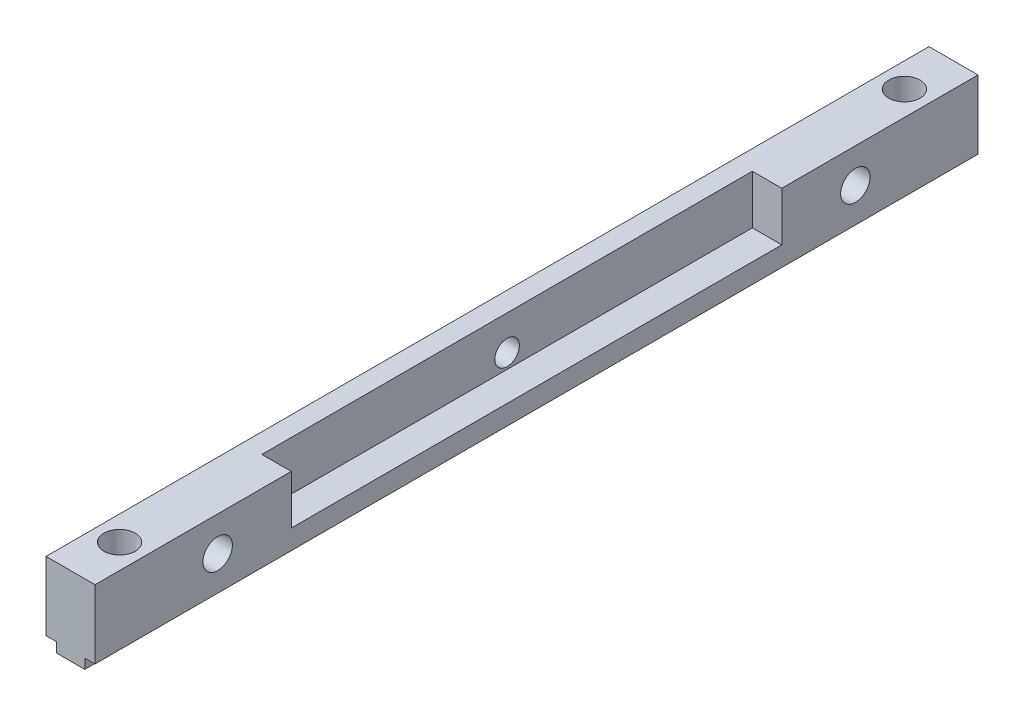
ISO-10303-21;
HEADER;
FILE_DESCRIPTION(('STEP AP214'),'2;1');
FILE_NAME('part.step','',(''),(''),'','','');
FILE_SCHEMA(('AUTOMOTIVE_DESIGN { 1 0 10303 214 1 1 1 1 }'));
ENDSEC;
DATA;
#1=APPLICATION_CONTEXT('core data for automotive mechanical design processes');
#2=APPLICATION_PROTOCOL_DEFINITION('international standard','automotive_design',2000,#1);
#3=PRODUCT_CONTEXT('',#1,'mechanical');
#4=PRODUCT('Part','Part','',(#3));
#5=PRODUCT_RELATED_PRODUCT_CATEGORY('part','',(#4));
#6=PRODUCT_DEFINITION_FORMATION('','',#4);
#7=PRODUCT_DEFINITION_CONTEXT('part definition',#1,'design');
#8=PRODUCT_DEFINITION('design','',#6,#7);
#9=PRODUCT_DEFINITION_SHAPE('','',#8);
#10=(LENGTH_UNIT() NAMED_UNIT(*) SI_UNIT(.MILLI.,.METRE.));
#11=(NAMED_UNIT(*) PLANE_ANGLE_UNIT() SI_UNIT($,.RADIAN.));
#12=(NAMED_UNIT(*) SI_UNIT($,.STERADIAN.) SOLID_ANGLE_UNIT());
#13=UNCERTAINTY_MEASURE_WITH_UNIT(LENGTH_MEASURE(1.E-05),#10,'distance_accuracy_value','');
#14=(GEOMETRIC_REPRESENTATION_CONTEXT(3) GLOBAL_UNCERTAINTY_ASSIGNED_CONTEXT((#13)) GLOBAL_UNIT_ASSIGNED_CONTEXT((#10,
#11,#12)) REPRESENTATION_CONTEXT('',''));
#15=CARTESIAN_POINT('',(0.,0.,0.));
#16=DIRECTION('',(0.,0.,1.));
#17=DIRECTION('',(1.,0.,0.));
#18=AXIS2_PLACEMENT_3D('',#15,#16,#17);
#19=CARTESIAN_POINT('',(3.95,0.,90.));
#20=DIRECTION('',(-1.,0.,0.));
#21=DIRECTION('',(0.,0.,1.));
#22=AXIS2_PLACEMENT_3D('',#19,#20,#21);
#23=PLANE('',#22);
#24=DIRECTION('',(0.,0.,-1.));
#25=VECTOR('',#24,1.);
#26=CARTESIAN_POINT('',(3.95,0.,90.));
#27=LINE('',#26,#25);
#28=CARTESIAN_POINT('',(3.95,0.,4.32361253707657));
#29=VERTEX_POINT('',#28);
#30=CARTESIAN_POINT('',(3.95,0.,0.));
#31=VERTEX_POINT('',#30);
#32=EDGE_CURVE('E304',#29,#31,#27,.T.);
#33=ORIENTED_EDGE('',*,*,#32,.F.);
#34=DIRECTION('',(0.,-1.,0.));
#35=VECTOR('',#34,1.);
#36=CARTESIAN_POINT('',(3.95,7.,4.32361253707657));
#37=LINE('',#36,#35);
#38=CARTESIAN_POINT('',(3.95,-1.,4.32361253707657));
#39=VERTEX_POINT('',#38);
#40=EDGE_CURVE('E57',#29,#39,#37,.T.);
#41=ORIENTED_EDGE('',*,*,#40,.T.);
#42=DIRECTION('',(0.,0.,-1.));
#43=VECTOR('',#42,1.);
#44=CARTESIAN_POINT('',(3.95,-1.,90.));
#45=LINE('',#44,#43);
#46=CARTESIAN_POINT('',(3.95,-1.,0.));
#47=VERTEX_POINT('',#46);
#48=EDGE_CURVE('E308',#39,#47,#45,.T.);
#49=ORIENTED_EDGE('',*,*,#48,.T.);
#50=DIRECTION('',(0.,1.,0.));
#51=VECTOR('',#50,1.);
#52=CARTESIAN_POINT('',(3.95,0.,0.));
#53=LINE('',#52,#51);
#54=EDGE_CURVE('E288',#47,#31,#53,.T.);
#55=ORIENTED_EDGE('',*,*,#54,.T.);
#56=EDGE_LOOP('',(#33,#41,#49,#55));
#57=FACE_BOUND('',#56,.T.);
#58=ADVANCED_FACE('F33',(#57),#23,.F.);
#59=CARTESIAN_POINT('',(1.05,-1.,90.));
#60=DIRECTION('',(1.,0.,0.));
#61=DIRECTION('',(0.,0.,-1.));
#62=AXIS2_PLACEMENT_3D('',#59,#60,#61);
#63=PLANE('',#62);
#64=DIRECTION('',(0.,0.,-1.));
#65=VECTOR('',#64,1.);
#66=CARTESIAN_POINT('',(1.05,0.,90.));
#67=LINE('',#66,#65);
#68=CARTESIAN_POINT('',(1.05,0.,84.3236125370766));
#69=VERTEX_POINT('',#68);
#70=CARTESIAN_POINT('',(1.05,0.,5.67638746292344));
#71=VERTEX_POINT('',#70);
#72=EDGE_CURVE('E321',#69,#71,#67,.T.);
#73=ORIENTED_EDGE('',*,*,#72,.T.);
#74=DIRECTION('',(0.,-1.,0.));
#75=VECTOR('',#74,1.);
#76=CARTESIAN_POINT('',(1.05,7.,5.67638746292344));
#77=LINE('',#76,#75);
#78=CARTESIAN_POINT('',(1.05,-1.,5.67638746292344));
#79=VERTEX_POINT('',#78);
#80=EDGE_CURVE('E218',#71,#79,#77,.T.);
#81=ORIENTED_EDGE('',*,*,#80,.T.);
#82=DIRECTION('',(0.,0.,-1.));
#83=VECTOR('',#82,1.);
#84=CARTESIAN_POINT('',(1.05,-1.,90.));
#85=LINE('',#84,#83);
#86=CARTESIAN_POINT('',(1.05,-1.,84.3236125370766));
#87=VERTEX_POINT('',#86);
#88=EDGE_CURVE('E319',#87,#79,#85,.T.);
#89=ORIENTED_EDGE('',*,*,#88,.F.);
#90=DIRECTION('',(0.,-1.,0.));
#91=VECTOR('',#90,1.);
#92=CARTESIAN_POINT('',(1.05,7.,84.3236125370766));
#93=LINE('',#92,#91);
#94=EDGE_CURVE('E236',#87,#69,#93,.F.);
#95=ORIENTED_EDGE('',*,*,#94,.T.);
#96=EDGE_LOOP('',(#73,#81,#89,#95));
#97=FACE_BOUND('',#96,.T.);
#98=ADVANCED_FACE('F353',(#97),#63,.F.);
#99=CARTESIAN_POINT('',(3.95,-1.,90.));
#100=DIRECTION('',(0.,1.,0.));
#101=DIRECTION('',(-1.,0.,0.));
#102=AXIS2_PLACEMENT_3D('',#99,#100,#101);
#103=PLANE('',#102);
#104=ORIENTED_EDGE('',*,*,#88,.T.);
#105=CARTESIAN_POINT('',(2.5,-1.,5.));
#106=DIRECTION('',(0.,-1.,0.));
#107=DIRECTION('',(0.,0.,-1.));
#108=AXIS2_PLACEMENT_3D('',#105,#106,#107);
#109=CIRCLE('',#108,1.6);
#110=CARTESIAN_POINT('',(3.95,-1.,5.67638746292344));
#111=VERTEX_POINT('',#110);
#112=EDGE_CURVE('E204',#111,#79,#109,.T.);
#113=ORIENTED_EDGE('',*,*,#112,.F.);
#114=CARTESIAN_POINT('',(3.95,-1.,84.3236125370766));
#115=VERTEX_POINT('',#114);
#116=EDGE_CURVE('E314',#115,#111,#45,.T.);
#117=ORIENTED_EDGE('',*,*,#116,.F.);
#118=CARTESIAN_POINT('',(2.5,-1.,85.));
#119=DIRECTION('',(0.,-1.,0.));
#120=DIRECTION('',(0.,0.,-1.));
#121=AXIS2_PLACEMENT_3D('',#118,#119,#120);
#122=CIRCLE('',#121,1.6);
#123=EDGE_CURVE('E221',#87,#115,#122,.T.);
#124=ORIENTED_EDGE('',*,*,#123,.F.);
#125=EDGE_LOOP('',(#104,#113,#117,#124));
#126=FACE_BOUND('',#125,.T.);
#127=ADVANCED_FACE('F349',(#126),#103,.F.);
#128=CARTESIAN_POINT('',(1.05,0.,90.));
#129=VERTEX_POINT('',#128);
#130=CARTESIAN_POINT('',(1.05,0.,85.6763874629234));
#131=VERTEX_POINT('',#130);
#132=EDGE_CURVE('E42',#129,#131,#67,.T.);
#133=ORIENTED_EDGE('',*,*,#132,.T.);
#134=DIRECTION('',(0.,-1.,0.));
#135=VECTOR('',#134,1.);
#136=CARTESIAN_POINT('',(1.05,7.,85.6763874629234));
#137=LINE('',#136,#135);
#138=CARTESIAN_POINT('',(1.05,-1.,85.6763874629234));
#139=VERTEX_POINT('',#138);
#140=EDGE_CURVE('E242',#131,#139,#137,.T.);
#141=ORIENTED_EDGE('',*,*,#140,.T.);
#142=CARTESIAN_POINT('',(1.05,-1.,90.));
#143=VERTEX_POINT('',#142);
#144=EDGE_CURVE('E315',#143,#139,#85,.T.);
#145=ORIENTED_EDGE('',*,*,#144,.F.);
#146=DIRECTION('',(0.,-1.,0.));
#147=VECTOR('',#146,1.);
#148=CARTESIAN_POINT('',(1.05,-1.,90.));
#149=LINE('',#148,#147);
#150=EDGE_CURVE('E264',#129,#143,#149,.T.);
#151=ORIENTED_EDGE('',*,*,#150,.F.);
#152=EDGE_LOOP('',(#133,#141,#145,#151));
#153=FACE_BOUND('',#152,.T.);
#154=ADVANCED_FACE('F360',(#153),#63,.F.);
#155=ORIENTED_EDGE('',*,*,#144,.T.);
#156=CARTESIAN_POINT('',(3.95,-1.,85.6763874629234));
#157=VERTEX_POINT('',#156);
#158=EDGE_CURVE('E226',#157,#139,#122,.T.);
#159=ORIENTED_EDGE('',*,*,#158,.F.);
#160=CARTESIAN_POINT('',(3.95,-1.,90.));
#161=VERTEX_POINT('',#160);
#162=EDGE_CURVE('E310',#161,#157,#45,.T.);
#163=ORIENTED_EDGE('',*,*,#162,.F.);
#164=DIRECTION('',(1.,0.,0.));
#165=VECTOR('',#164,1.);
#166=CARTESIAN_POINT('',(3.95,-1.,90.));
#167=LINE('',#166,#165);
#168=EDGE_CURVE('E266',#143,#161,#167,.T.);
#169=ORIENTED_EDGE('',*,*,#168,.F.);
#170=EDGE_LOOP('',(#155,#159,#163,#169));
#171=FACE_BOUND('',#170,.T.);
#172=ADVANCED_FACE('F363',(#171),#103,.F.);
#173=ORIENTED_EDGE('',*,*,#116,.T.);
#174=DIRECTION('',(0.,-1.,0.));
#175=VECTOR('',#174,1.);
#176=CARTESIAN_POINT('',(3.95,7.,5.67638746292343));
#177=LINE('',#176,#175);
#178=CARTESIAN_POINT('',(3.95,0.,5.67638746292344));
#179=VERTEX_POINT('',#178);
#180=EDGE_CURVE('E208',#111,#179,#177,.F.);
#181=ORIENTED_EDGE('',*,*,#180,.T.);
#182=CARTESIAN_POINT('',(3.95,0.,84.3236125370766));
#183=VERTEX_POINT('',#182);
#184=EDGE_CURVE('E309',#183,#179,#27,.T.);
#185=ORIENTED_EDGE('',*,*,#184,.F.);
#186=DIRECTION('',(0.,-1.,0.));
#187=VECTOR('',#186,1.);
#188=CARTESIAN_POINT('',(3.95,7.,84.3236125370766));
#189=LINE('',#188,#187);
#190=EDGE_CURVE('E233',#183,#115,#189,.T.);
#191=ORIENTED_EDGE('',*,*,#190,.T.);
#192=EDGE_LOOP('',(#173,#181,#185,#191));
#193=FACE_BOUND('',#192,.T.);
#194=ADVANCED_FACE('F387',(#193),#23,.F.);
#195=CARTESIAN_POINT('',(0.,0.,90.));
#196=DIRECTION('',(1.,0.,0.));
#197=DIRECTION('',(0.,0.,-1.));
#198=AXIS2_PLACEMENT_3D('',#195,#196,#197);
#199=PLANE('',#198);
#200=CARTESIAN_POINT('',(0.,3.49999999999999,45.));
#201=DIRECTION('',(-1.,0.,0.));
#202=DIRECTION('',(0.,0.,1.));
#203=AXIS2_PLACEMENT_3D('',#200,#201,#202);
#204=CIRCLE('',#203,1.25);
#205=CARTESIAN_POINT('',(0.,3.49999999999999,46.25));
#206=VERTEX_POINT('',#205);
#207=EDGE_CURVE('E619',#206,#206,#204,.T.);
#208=ORIENTED_EDGE('',*,*,#207,.F.);
#209=EDGE_LOOP('',(#208));
#210=FACE_BOUND('',#209,.T.);
#211=CARTESIAN_POINT('',(0.,3.5,77.5));
#212=DIRECTION('',(1.,0.,0.));
#213=DIRECTION('',(0.,0.,-1.));
#214=AXIS2_PLACEMENT_3D('',#211,#212,#213);
#215=CIRCLE('',#214,1.5);
#216=CARTESIAN_POINT('',(0.,3.5,76.));
#217=VERTEX_POINT('',#216);
#218=EDGE_CURVE('E246',#217,#217,#215,.T.);
#219=ORIENTED_EDGE('',*,*,#218,.T.);
#220=EDGE_LOOP('',(#219));
#221=FACE_BOUND('',#220,.T.);
#222=CARTESIAN_POINT('',(0.,3.5,12.5));
#223=DIRECTION('',(1.,0.,0.));
#224=DIRECTION('',(0.,0.,-1.));
#225=AXIS2_PLACEMENT_3D('',#222,#223,#224);
#226=CIRCLE('',#225,1.5);
#227=CARTESIAN_POINT('',(0.,3.5,11.));
#228=VERTEX_POINT('',#227);
#229=EDGE_CURVE('E252',#228,#228,#226,.T.);
#230=ORIENTED_EDGE('',*,*,#229,.T.);
#231=EDGE_LOOP('',(#230));
#232=FACE_BOUND('',#231,.T.);
#233=DIRECTION('',(0.,-1.,0.));
#234=VECTOR('',#233,1.);
#235=CARTESIAN_POINT('',(0.,0.,0.));
#236=LINE('',#235,#234);
#237=CARTESIAN_POINT('',(0.,7.,0.));
#238=VERTEX_POINT('',#237);
#239=CARTESIAN_POINT('',(0.,0.,0.));
#240=VERTEX_POINT('',#239);
#241=EDGE_CURVE('E255',#238,#240,#236,.T.);
#242=ORIENTED_EDGE('',*,*,#241,.T.);
#243=DIRECTION('',(0.,0.,-1.));
#244=VECTOR('',#243,1.);
#245=CARTESIAN_POINT('',(0.,0.,90.));
#246=LINE('',#245,#244);
#247=CARTESIAN_POINT('',(0.,0.,90.));
#248=VERTEX_POINT('',#247);
#249=EDGE_CURVE('E11',#248,#240,#246,.T.);
#250=ORIENTED_EDGE('',*,*,#249,.F.);
#251=DIRECTION('',(0.,-1.,0.));
#252=VECTOR('',#251,1.);
#253=CARTESIAN_POINT('',(0.,0.,90.));
#254=LINE('',#253,#252);
#255=CARTESIAN_POINT('',(0.,7.,90.));
#256=VERTEX_POINT('',#255);
#257=EDGE_CURVE('E258',#256,#248,#254,.T.);
#258=ORIENTED_EDGE('',*,*,#257,.F.);
#259=DIRECTION('',(0.,0.,-1.));
#260=VECTOR('',#259,1.);
#261=CARTESIAN_POINT('',(0.,7.,90.));
#262=LINE('',#261,#260);
#263=EDGE_CURVE('E276',#256,#238,#262,.T.);
#264=ORIENTED_EDGE('',*,*,#263,.T.);
#265=EDGE_LOOP('',(#242,#250,#258,#264));
#266=FACE_BOUND('',#265,.T.);
#267=ADVANCED_FACE('F35',(#210,#221,#232,#266),#199,.F.);
#268=CARTESIAN_POINT('',(1.05,0.,90.));
#269=DIRECTION('',(0.,1.,0.));
#270=DIRECTION('',(-1.,0.,0.));
#271=AXIS2_PLACEMENT_3D('',#268,#269,#270);
#272=PLANE('',#271);
#273=CARTESIAN_POINT('',(1.05,0.,4.32361253707656));
#274=VERTEX_POINT('',#273);
#275=CARTESIAN_POINT('',(1.05,0.,0.));
#276=VERTEX_POINT('',#275);
#277=EDGE_CURVE('E318',#274,#276,#67,.T.);
#278=ORIENTED_EDGE('',*,*,#277,.F.);
#279=CARTESIAN_POINT('',(2.5,0.,5.));
#280=DIRECTION('',(0.,1.,0.));
#281=DIRECTION('',(-1.,0.,0.));
#282=AXIS2_PLACEMENT_3D('',#279,#280,#281);
#283=CIRCLE('',#282,1.6);
#284=EDGE_CURVE('E215',#274,#71,#283,.T.);
#285=ORIENTED_EDGE('',*,*,#284,.T.);
#286=ORIENTED_EDGE('',*,*,#72,.F.);
#287=CARTESIAN_POINT('',(2.5,0.,85.));
#288=DIRECTION('',(0.,1.,0.));
#289=DIRECTION('',(-1.,0.,0.));
#290=AXIS2_PLACEMENT_3D('',#287,#288,#289);
#291=CIRCLE('',#290,1.6);
#292=EDGE_CURVE('E239',#69,#131,#291,.T.);
#293=ORIENTED_EDGE('',*,*,#292,.T.);
#294=ORIENTED_EDGE('',*,*,#132,.F.);
#295=DIRECTION('',(1.,0.,0.));
#296=VECTOR('',#295,1.);
#297=CARTESIAN_POINT('',(1.05,0.,90.));
#298=LINE('',#297,#296);
#299=EDGE_CURVE('E261',#248,#129,#298,.T.);
#300=ORIENTED_EDGE('',*,*,#299,.F.);
#301=ORIENTED_EDGE('',*,*,#249,.T.);
#302=DIRECTION('',(1.,0.,0.));
#303=VECTOR('',#302,1.);
#304=CARTESIAN_POINT('',(1.05,0.,0.));
#305=LINE('',#304,#303);
#306=EDGE_CURVE('E279',#240,#276,#305,.T.);
#307=ORIENTED_EDGE('',*,*,#306,.T.);
#308=EDGE_LOOP('',(#278,#285,#286,#293,#294,#300,#301,#307));
#309=FACE_BOUND('',#308,.T.);
#310=ADVANCED_FACE('F333',(#309),#272,.F.);
#311=CARTESIAN_POINT('',(1.05,-1.,4.32361253707657));
#312=VERTEX_POINT('',#311);
#313=CARTESIAN_POINT('',(1.05,-1.,0.));
#314=VERTEX_POINT('',#313);
#315=EDGE_CURVE('E313',#312,#314,#85,.T.);
#316=ORIENTED_EDGE('',*,*,#315,.F.);
#317=DIRECTION('',(0.,-1.,0.));
#318=VECTOR('',#317,1.);
#319=CARTESIAN_POINT('',(1.05,7.,4.32361253707656));
#320=LINE('',#319,#318);
#321=EDGE_CURVE('E212',#312,#274,#320,.F.);
#322=ORIENTED_EDGE('',*,*,#321,.T.);
#323=ORIENTED_EDGE('',*,*,#277,.T.);
#324=DIRECTION('',(0.,-1.,0.));
#325=VECTOR('',#324,1.);
#326=CARTESIAN_POINT('',(1.05,-1.,0.));
#327=LINE('',#326,#325);
#328=EDGE_CURVE('E282',#276,#314,#327,.T.);
#329=ORIENTED_EDGE('',*,*,#328,.T.);
#330=EDGE_LOOP('',(#316,#322,#323,#329));
#331=FACE_BOUND('',#330,.T.);
#332=ADVANCED_FACE('F329',(#331),#63,.F.);
#333=ORIENTED_EDGE('',*,*,#48,.F.);
#334=EDGE_CURVE('E205',#312,#39,#109,.T.);
#335=ORIENTED_EDGE('',*,*,#334,.F.);
#336=ORIENTED_EDGE('',*,*,#315,.T.);
#337=DIRECTION('',(1.,0.,0.));
#338=VECTOR('',#337,1.);
#339=CARTESIAN_POINT('',(3.95,-1.,0.));
#340=LINE('',#339,#338);
#341=EDGE_CURVE('E285',#314,#47,#340,.T.);
#342=ORIENTED_EDGE('',*,*,#341,.T.);
#343=EDGE_LOOP('',(#333,#335,#336,#342));
#344=FACE_BOUND('',#343,.T.);
#345=ADVANCED_FACE('F342',(#344),#103,.F.);
#346=ORIENTED_EDGE('',*,*,#162,.T.);
#347=DIRECTION('',(0.,-1.,0.));
#348=VECTOR('',#347,1.);
#349=CARTESIAN_POINT('',(3.95,7.,85.6763874629234));
#350=LINE('',#349,#348);
#351=CARTESIAN_POINT('',(3.95,0.,85.6763874629234));
#352=VERTEX_POINT('',#351);
#353=EDGE_CURVE('E230',#157,#352,#350,.F.);
#354=ORIENTED_EDGE('',*,*,#353,.T.);
#355=CARTESIAN_POINT('',(3.95,0.,90.));
#356=VERTEX_POINT('',#355);
#357=EDGE_CURVE('E305',#356,#352,#27,.T.);
#358=ORIENTED_EDGE('',*,*,#357,.F.);
#359=DIRECTION('',(0.,1.,0.));
#360=VECTOR('',#359,1.);
#361=CARTESIAN_POINT('',(3.95,0.,90.));
#362=LINE('',#361,#360);
#363=EDGE_CURVE('E268',#161,#356,#362,.T.);
#364=ORIENTED_EDGE('',*,*,#363,.F.);
#365=EDGE_LOOP('',(#346,#354,#358,#364));
#366=FACE_BOUND('',#365,.T.);
#367=ADVANCED_FACE('F390',(#366),#23,.F.);
#368=CARTESIAN_POINT('',(4.99999999999999,0.,90.));
#369=DIRECTION('',(0.,1.,0.));
#370=DIRECTION('',(-1.,0.,0.));
#371=AXIS2_PLACEMENT_3D('',#368,#369,#370);
#372=PLANE('',#371);
#373=ORIENTED_EDGE('',*,*,#184,.T.);
#374=CARTESIAN_POINT('',(2.5,0.,5.));
#375=DIRECTION('',(0.,1.,0.));
#376=DIRECTION('',(-1.,0.,0.));
#377=AXIS2_PLACEMENT_3D('',#374,#375,#376);
#378=CIRCLE('',#377,1.6);
#379=EDGE_CURVE('E203',#179,#29,#378,.T.);
#380=ORIENTED_EDGE('',*,*,#379,.T.);
#381=ORIENTED_EDGE('',*,*,#32,.T.);
#382=DIRECTION('',(1.,0.,0.));
#383=VECTOR('',#382,1.);
#384=CARTESIAN_POINT('',(4.99999999999999,0.,0.));
#385=LINE('',#384,#383);
#386=CARTESIAN_POINT('',(4.99999999999999,0.,0.));
#387=VERTEX_POINT('',#386);
#388=EDGE_CURVE('E291',#31,#387,#385,.T.);
#389=ORIENTED_EDGE('',*,*,#388,.T.);
#390=DIRECTION('',(0.,0.,-1.));
#391=VECTOR('',#390,1.);
#392=CARTESIAN_POINT('',(4.99999999999999,0.,90.));
#393=LINE('',#392,#391);
#394=CARTESIAN_POINT('',(4.99999999999999,0.,90.));
#395=VERTEX_POINT('',#394);
#396=EDGE_CURVE('E301',#395,#387,#393,.T.);
#397=ORIENTED_EDGE('',*,*,#396,.F.);
#398=DIRECTION('',(1.,0.,0.));
#399=VECTOR('',#398,1.);
#400=CARTESIAN_POINT('',(4.99999999999999,0.,90.));
#401=LINE('',#400,#399);
#402=EDGE_CURVE('E270',#356,#395,#401,.T.);
#403=ORIENTED_EDGE('',*,*,#402,.F.);
#404=ORIENTED_EDGE('',*,*,#357,.T.);
#405=CARTESIAN_POINT('',(2.5,0.,85.));
#406=DIRECTION('',(0.,1.,0.));
#407=DIRECTION('',(-1.,0.,0.));
#408=AXIS2_PLACEMENT_3D('',#405,#406,#407);
#409=CIRCLE('',#408,1.6);
#410=EDGE_CURVE('E225',#352,#183,#409,.T.);
#411=ORIENTED_EDGE('',*,*,#410,.T.);
#412=EDGE_LOOP('',(#373,#380,#381,#389,#397,#403,#404,#411));
#413=FACE_BOUND('',#412,.T.);
#414=ADVANCED_FACE('F383',(#413),#372,.F.);
#415=CARTESIAN_POINT('',(4.99999999999999,7.,90.));
#416=DIRECTION('',(-1.,0.,0.));
#417=DIRECTION('',(0.,-1.,0.));
#418=AXIS2_PLACEMENT_3D('',#415,#416,#417);
#419=PLANE('',#418);
#420=CARTESIAN_POINT('',(4.99999999999999,3.5,77.5));
#421=DIRECTION('',(1.,0.,0.));
#422=DIRECTION('',(0.,0.,-1.));
#423=AXIS2_PLACEMENT_3D('',#420,#421,#422);
#424=CIRCLE('',#423,1.5);
#425=CARTESIAN_POINT('',(4.99999999999999,3.5,76.));
#426=VERTEX_POINT('',#425);
#427=EDGE_CURVE('E245',#426,#426,#424,.T.);
#428=ORIENTED_EDGE('',*,*,#427,.F.);
#429=EDGE_LOOP('',(#428));
#430=FACE_BOUND('',#429,.T.);
#431=CARTESIAN_POINT('',(4.99999999999999,3.5,12.5));
#432=DIRECTION('',(1.,0.,0.));
#433=DIRECTION('',(0.,0.,-1.));
#434=AXIS2_PLACEMENT_3D('',#431,#432,#433);
#435=CIRCLE('',#434,1.5);
#436=CARTESIAN_POINT('',(4.99999999999999,3.5,11.));
#437=VERTEX_POINT('',#436);
#438=EDGE_CURVE('E249',#437,#437,#435,.T.);
#439=ORIENTED_EDGE('',*,*,#438,.F.);
#440=EDGE_LOOP('',(#439));
#441=FACE_BOUND('',#440,.T.);
#442=DIRECTION('',(0.,0.,-1.));
#443=VECTOR('',#442,1.);
#444=CARTESIAN_POINT('',(4.99999999999999,7.,90.));
#445=LINE('',#444,#443);
#446=CARTESIAN_POINT('',(4.99999999999999,7.,20.));
#447=VERTEX_POINT('',#446);
#448=CARTESIAN_POINT('',(4.99999999999999,7.,0.));
#449=VERTEX_POINT('',#448);
#450=EDGE_CURVE('E299',#447,#449,#445,.T.);
#451=ORIENTED_EDGE('',*,*,#450,.F.);
#452=DIRECTION('',(0.,1.,0.));
#453=VECTOR('',#452,1.);
#454=CARTESIAN_POINT('',(4.99999999999999,2.,20.));
#455=LINE('',#454,#453);
#456=CARTESIAN_POINT('',(4.99999999999999,2.,20.));
#457=VERTEX_POINT('',#456);
#458=EDGE_CURVE('E611',#457,#447,#455,.T.);
#459=ORIENTED_EDGE('',*,*,#458,.F.);
#460=DIRECTION('',(0.,0.,-1.));
#461=VECTOR('',#460,1.);
#462=CARTESIAN_POINT('',(4.99999999999999,2.,20.));
#463=LINE('',#462,#461);
#464=CARTESIAN_POINT('',(4.99999999999999,1.99999999999999,70.));
#465=VERTEX_POINT('',#464);
#466=EDGE_CURVE('E616',#465,#457,#463,.T.);
#467=ORIENTED_EDGE('',*,*,#466,.F.);
#468=DIRECTION('',(0.,-1.,0.));
#469=VECTOR('',#468,1.);
#470=CARTESIAN_POINT('',(4.99999999999999,1.99999999999999,70.));
#471=LINE('',#470,#469);
#472=CARTESIAN_POINT('',(4.99999999999999,7.,70.));
#473=VERTEX_POINT('',#472);
#474=EDGE_CURVE('E614',#473,#465,#471,.T.);
#475=ORIENTED_EDGE('',*,*,#474,.F.);
#476=CARTESIAN_POINT('',(4.99999999999999,7.,90.));
#477=VERTEX_POINT('',#476);
#478=EDGE_CURVE('E192',#477,#473,#445,.T.);
#479=ORIENTED_EDGE('',*,*,#478,.F.);
#480=DIRECTION('',(0.,1.,0.));
#481=VECTOR('',#480,1.);
#482=CARTESIAN_POINT('',(4.99999999999999,7.,90.));
#483=LINE('',#482,#481);
#484=EDGE_CURVE('E272',#395,#477,#483,.T.);
#485=ORIENTED_EDGE('',*,*,#484,.F.);
#486=ORIENTED_EDGE('',*,*,#396,.T.);
#487=DIRECTION('',(0.,1.,0.));
#488=VECTOR('',#487,1.);
#489=CARTESIAN_POINT('',(4.99999999999999,7.,0.));
#490=LINE('',#489,#488);
#491=EDGE_CURVE('E293',#387,#449,#490,.T.);
#492=ORIENTED_EDGE('',*,*,#491,.T.);
#493=EDGE_LOOP('',(#451,#459,#467,#475,#479,#485,#486,#492));
#494=FACE_BOUND('',#493,.T.);
#495=ADVANCED_FACE('F377',(#430,#441,#494),#419,.F.);
#496=CARTESIAN_POINT('',(0.,7.,90.));
#497=DIRECTION('',(0.,-1.,0.));
#498=DIRECTION('',(0.,0.,-1.));
#499=AXIS2_PLACEMENT_3D('',#496,#497,#498);
#500=PLANE('',#499);
#501=CARTESIAN_POINT('',(2.5,7.,5.));
#502=DIRECTION('',(0.,-1.,0.));
#503=DIRECTION('',(0.,0.,-1.));
#504=AXIS2_PLACEMENT_3D('',#501,#502,#503);
#505=CIRCLE('',#504,1.6);
#506=CARTESIAN_POINT('',(2.5,7.,3.4));
#507=VERTEX_POINT('',#506);
#508=EDGE_CURVE('E200',#507,#507,#505,.T.);
#509=ORIENTED_EDGE('',*,*,#508,.T.);
#510=EDGE_LOOP('',(#509));
#511=FACE_BOUND('',#510,.T.);
#512=CARTESIAN_POINT('',(2.5,7.,85.));
#513=DIRECTION('',(0.,-1.,0.));
#514=DIRECTION('',(0.,0.,-1.));
#515=AXIS2_PLACEMENT_3D('',#512,#513,#514);
#516=CIRCLE('',#515,1.6);
#517=CARTESIAN_POINT('',(2.5,7.,83.4));
#518=VERTEX_POINT('',#517);
#519=EDGE_CURVE('E222',#518,#518,#516,.T.);
#520=ORIENTED_EDGE('',*,*,#519,.T.);
#521=EDGE_LOOP('',(#520));
#522=FACE_BOUND('',#521,.T.);
#523=DIRECTION('',(0.,0.,1.));
#524=VECTOR('',#523,1.);
#525=CARTESIAN_POINT('',(1.99999999999999,7.,20.));
#526=LINE('',#525,#524);
#527=CARTESIAN_POINT('',(1.99999999999999,7.,20.));
#528=VERTEX_POINT('',#527);
#529=CARTESIAN_POINT('',(1.99999999999999,7.,70.));
#530=VERTEX_POINT('',#529);
#531=EDGE_CURVE('E181',#528,#530,#526,.T.);
#532=ORIENTED_EDGE('',*,*,#531,.F.);
#533=DIRECTION('',(1.,0.,0.));
#534=VECTOR('',#533,1.);
#535=CARTESIAN_POINT('',(1.99999999999999,7.,20.));
#536=LINE('',#535,#534);
#537=EDGE_CURVE('E193',#528,#447,#536,.T.);
#538=ORIENTED_EDGE('',*,*,#537,.T.);
#539=ORIENTED_EDGE('',*,*,#450,.T.);
#540=DIRECTION('',(-1.,0.,0.));
#541=VECTOR('',#540,1.);
#542=CARTESIAN_POINT('',(0.,7.,0.));
#543=LINE('',#542,#541);
#544=EDGE_CURVE('E262',#449,#238,#543,.T.);
#545=ORIENTED_EDGE('',*,*,#544,.T.);
#546=ORIENTED_EDGE('',*,*,#263,.F.);
#547=DIRECTION('',(-1.,0.,0.));
#548=VECTOR('',#547,1.);
#549=CARTESIAN_POINT('',(0.,7.,90.));
#550=LINE('',#549,#548);
#551=EDGE_CURVE('E274',#477,#256,#550,.T.);
#552=ORIENTED_EDGE('',*,*,#551,.F.);
#553=ORIENTED_EDGE('',*,*,#478,.T.);
#554=DIRECTION('',(1.,0.,0.));
#555=VECTOR('',#554,1.);
#556=CARTESIAN_POINT('',(1.99999999999999,7.,70.));
#557=LINE('',#556,#555);
#558=EDGE_CURVE('E176',#530,#473,#557,.T.);
#559=ORIENTED_EDGE('',*,*,#558,.F.);
#560=EDGE_LOOP('',(#532,#538,#539,#545,#546,#552,#553,#559));
#561=FACE_BOUND('',#560,.T.);
#562=ADVANCED_FACE('F189',(#511,#522,#561),#500,.F.);
#563=CARTESIAN_POINT('',(0.,0.,90.));
#564=DIRECTION('',(0.,0.,-1.));
#565=DIRECTION('',(-1.,0.,0.));
#566=AXIS2_PLACEMENT_3D('',#563,#564,#565);
#567=PLANE('',#566);
#568=ORIENTED_EDGE('',*,*,#257,.T.);
#569=ORIENTED_EDGE('',*,*,#299,.T.);
#570=ORIENTED_EDGE('',*,*,#150,.T.);
#571=ORIENTED_EDGE('',*,*,#168,.T.);
#572=ORIENTED_EDGE('',*,*,#363,.T.);
#573=ORIENTED_EDGE('',*,*,#402,.T.);
#574=ORIENTED_EDGE('',*,*,#484,.T.);
#575=ORIENTED_EDGE('',*,*,#551,.T.);
#576=EDGE_LOOP('',(#568,#569,#570,#571,#572,#573,#574,#575));
#577=FACE_BOUND('',#576,.T.);
#578=ADVANCED_FACE('F367',(#577),#567,.F.);
#579=CARTESIAN_POINT('',(0.,0.,0.));
#580=DIRECTION('',(0.,0.,-1.));
#581=DIRECTION('',(-1.,0.,0.));
#582=AXIS2_PLACEMENT_3D('',#579,#580,#581);
#583=PLANE('',#582);
#584=ORIENTED_EDGE('',*,*,#241,.F.);
#585=ORIENTED_EDGE('',*,*,#544,.F.);
#586=ORIENTED_EDGE('',*,*,#491,.F.);
#587=ORIENTED_EDGE('',*,*,#388,.F.);
#588=ORIENTED_EDGE('',*,*,#54,.F.);
#589=ORIENTED_EDGE('',*,*,#341,.F.);
#590=ORIENTED_EDGE('',*,*,#328,.F.);
#591=ORIENTED_EDGE('',*,*,#306,.F.);
#592=EDGE_LOOP('',(#584,#585,#586,#587,#588,#589,#590,#591));
#593=FACE_BOUND('',#592,.T.);
#594=ADVANCED_FACE('F337',(#593),#583,.T.);
#595=CARTESIAN_POINT('',(0.,3.5,12.5));
#596=DIRECTION('',(1.,0.,0.));
#597=DIRECTION('',(0.,0.,-1.));
#598=AXIS2_PLACEMENT_3D('',#595,#596,#597);
#599=CYLINDRICAL_SURFACE('',#598,1.5);
#600=ORIENTED_EDGE('',*,*,#229,.F.);
#601=EDGE_LOOP('',(#600));
#602=FACE_BOUND('',#601,.T.);
#603=ORIENTED_EDGE('',*,*,#438,.T.);
#604=EDGE_LOOP('',(#603));
#605=FACE_BOUND('',#604,.T.);
#606=ADVANCED_FACE('F526',(#602,#605),#599,.F.);
#607=CARTESIAN_POINT('',(0.,3.5,77.5));
#608=DIRECTION('',(1.,0.,0.));
#609=DIRECTION('',(0.,0.,-1.));
#610=AXIS2_PLACEMENT_3D('',#607,#608,#609);
#611=CYLINDRICAL_SURFACE('',#610,1.5);
#612=ORIENTED_EDGE('',*,*,#218,.F.);
#613=EDGE_LOOP('',(#612));
#614=FACE_BOUND('',#613,.T.);
#615=ORIENTED_EDGE('',*,*,#427,.T.);
#616=EDGE_LOOP('',(#615));
#617=FACE_BOUND('',#616,.T.);
#618=ADVANCED_FACE('F490',(#614,#617),#611,.F.);
#619=CARTESIAN_POINT('',(2.5,7.,85.));
#620=DIRECTION('',(0.,-1.,0.));
#621=DIRECTION('',(0.,0.,-1.));
#622=AXIS2_PLACEMENT_3D('',#619,#620,#621);
#623=CYLINDRICAL_SURFACE('',#622,1.6);
#624=ORIENTED_EDGE('',*,*,#519,.F.);
#625=EDGE_LOOP('',(#624));
#626=FACE_BOUND('',#625,.T.);
#627=ORIENTED_EDGE('',*,*,#292,.F.);
#628=ORIENTED_EDGE('',*,*,#94,.F.);
#629=ORIENTED_EDGE('',*,*,#123,.T.);
#630=ORIENTED_EDGE('',*,*,#190,.F.);
#631=ORIENTED_EDGE('',*,*,#410,.F.);
#632=ORIENTED_EDGE('',*,*,#353,.F.);
#633=ORIENTED_EDGE('',*,*,#158,.T.);
#634=ORIENTED_EDGE('',*,*,#140,.F.);
#635=EDGE_LOOP('',(#627,#628,#629,#630,#631,#632,#633,#634));
#636=FACE_BOUND('',#635,.T.);
#637=ADVANCED_FACE('F357',(#626,#636),#623,.F.);
#638=CARTESIAN_POINT('',(2.5,7.,5.));
#639=DIRECTION('',(0.,-1.,0.));
#640=DIRECTION('',(0.,0.,-1.));
#641=AXIS2_PLACEMENT_3D('',#638,#639,#640);
#642=CYLINDRICAL_SURFACE('',#641,1.6);
#643=ORIENTED_EDGE('',*,*,#508,.F.);
#644=EDGE_LOOP('',(#643));
#645=FACE_BOUND('',#644,.T.);
#646=ORIENTED_EDGE('',*,*,#284,.F.);
#647=ORIENTED_EDGE('',*,*,#321,.F.);
#648=ORIENTED_EDGE('',*,*,#334,.T.);
#649=ORIENTED_EDGE('',*,*,#40,.F.);
#650=ORIENTED_EDGE('',*,*,#379,.F.);
#651=ORIENTED_EDGE('',*,*,#180,.F.);
#652=ORIENTED_EDGE('',*,*,#112,.T.);
#653=ORIENTED_EDGE('',*,*,#80,.F.);
#654=EDGE_LOOP('',(#646,#647,#648,#649,#650,#651,#652,#653));
#655=FACE_BOUND('',#654,.T.);
#656=ADVANCED_FACE('F355',(#645,#655),#642,.F.);
#657=CARTESIAN_POINT('',(1.99999999999999,2.,20.));
#658=DIRECTION('',(0.,0.,-1.));
#659=DIRECTION('',(-1.,0.,0.));
#660=AXIS2_PLACEMENT_3D('',#657,#658,#659);
#661=PLANE('',#660);
#662=ORIENTED_EDGE('',*,*,#458,.T.);
#663=ORIENTED_EDGE('',*,*,#537,.F.);
#664=DIRECTION('',(0.,1.,0.));
#665=VECTOR('',#664,1.);
#666=CARTESIAN_POINT('',(1.99999999999999,2.,20.));
#667=LINE('',#666,#665);
#668=CARTESIAN_POINT('',(1.99999999999999,2.,20.));
#669=VERTEX_POINT('',#668);
#670=EDGE_CURVE('E49',#669,#528,#667,.T.);
#671=ORIENTED_EDGE('',*,*,#670,.F.);
#672=DIRECTION('',(1.,0.,0.));
#673=VECTOR('',#672,1.);
#674=CARTESIAN_POINT('',(1.99999999999999,2.,20.));
#675=LINE('',#674,#673);
#676=EDGE_CURVE('E195',#669,#457,#675,.T.);
#677=ORIENTED_EDGE('',*,*,#676,.T.);
#678=EDGE_LOOP('',(#662,#663,#671,#677));
#679=FACE_BOUND('',#678,.T.);
#680=ADVANCED_FACE('F463',(#679),#661,.F.);
#681=CARTESIAN_POINT('',(1.99999999999999,2.,20.));
#682=DIRECTION('',(0.,-1.,0.));
#683=DIRECTION('',(1.,0.,0.));
#684=AXIS2_PLACEMENT_3D('',#681,#682,#683);
#685=PLANE('',#684);
#686=ORIENTED_EDGE('',*,*,#466,.T.);
#687=ORIENTED_EDGE('',*,*,#676,.F.);
#688=DIRECTION('',(0.,0.,-1.));
#689=VECTOR('',#688,1.);
#690=CARTESIAN_POINT('',(1.99999999999999,2.,20.));
#691=LINE('',#690,#689);
#692=CARTESIAN_POINT('',(1.99999999999999,1.99999999999999,70.));
#693=VERTEX_POINT('',#692);
#694=EDGE_CURVE('E180',#693,#669,#691,.T.);
#695=ORIENTED_EDGE('',*,*,#694,.F.);
#696=DIRECTION('',(1.,0.,0.));
#697=VECTOR('',#696,1.);
#698=CARTESIAN_POINT('',(1.99999999999999,1.99999999999999,70.));
#699=LINE('',#698,#697);
#700=EDGE_CURVE('E178',#693,#465,#699,.T.);
#701=ORIENTED_EDGE('',*,*,#700,.T.);
#702=EDGE_LOOP('',(#686,#687,#695,#701));
#703=FACE_BOUND('',#702,.T.);
#704=ADVANCED_FACE('F457',(#703),#685,.F.);
#705=CARTESIAN_POINT('',(1.99999999999999,1.99999999999999,70.));
#706=DIRECTION('',(0.,0.,1.));
#707=DIRECTION('',(1.,0.,0.));
#708=AXIS2_PLACEMENT_3D('',#705,#706,#707);
#709=PLANE('',#708);
#710=ORIENTED_EDGE('',*,*,#474,.T.);
#711=ORIENTED_EDGE('',*,*,#700,.F.);
#712=DIRECTION('',(0.,-1.,0.));
#713=VECTOR('',#712,1.);
#714=CARTESIAN_POINT('',(1.99999999999999,1.99999999999999,70.));
#715=LINE('',#714,#713);
#716=EDGE_CURVE('E172',#530,#693,#715,.T.);
#717=ORIENTED_EDGE('',*,*,#716,.F.);
#718=ORIENTED_EDGE('',*,*,#558,.T.);
#719=EDGE_LOOP('',(#710,#711,#717,#718));
#720=FACE_BOUND('',#719,.T.);
#721=ADVANCED_FACE('F174',(#720),#709,.F.);
#722=CARTESIAN_POINT('',(1.99999999999999,0.,0.));
#723=DIRECTION('',(1.,0.,0.));
#724=DIRECTION('',(0.,1.,0.));
#725=AXIS2_PLACEMENT_3D('',#722,#723,#724);
#726=PLANE('',#725);
#727=CARTESIAN_POINT('',(1.99999999999999,3.49999999999999,45.));
#728=DIRECTION('',(1.,0.,0.));
#729=DIRECTION('',(0.,1.,0.));
#730=AXIS2_PLACEMENT_3D('',#727,#728,#729);
#731=CIRCLE('',#730,1.25);
#732=CARTESIAN_POINT('',(1.99999999999999,4.74999999999999,45.));
#733=VERTEX_POINT('',#732);
#734=EDGE_CURVE('E37',#733,#733,#731,.T.);
#735=ORIENTED_EDGE('',*,*,#734,.F.);
#736=EDGE_LOOP('',(#735));
#737=FACE_BOUND('',#736,.T.);
#738=ORIENTED_EDGE('',*,*,#670,.T.);
#739=ORIENTED_EDGE('',*,*,#531,.T.);
#740=ORIENTED_EDGE('',*,*,#716,.T.);
#741=ORIENTED_EDGE('',*,*,#694,.T.);
#742=EDGE_LOOP('',(#738,#739,#740,#741));
#743=FACE_BOUND('',#742,.T.);
#744=ADVANCED_FACE('F184',(#737,#743),#726,.T.);
#745=CARTESIAN_POINT('',(4.99999999999999,3.49999999999999,45.));
#746=DIRECTION('',(-1.,0.,0.));
#747=DIRECTION('',(0.,0.,1.));
#748=AXIS2_PLACEMENT_3D('',#745,#746,#747);
#749=CYLINDRICAL_SURFACE('',#748,1.25);
#750=ORIENTED_EDGE('',*,*,#734,.T.);
#751=EDGE_LOOP('',(#750));
#752=FACE_BOUND('',#751,.T.);
#753=ORIENTED_EDGE('',*,*,#207,.T.);
#754=EDGE_LOOP('',(#753));
#755=FACE_BOUND('',#754,.T.);
#756=ADVANCED_FACE('F439',(#752,#755),#749,.F.);
#757=CLOSED_SHELL('',(#58,#98,#127,#154,#172,#194,#267,#310,#332,#345,#367,#414,#495,#562,#578,
#594,#606,#618,#637,#656,#680,#704,#721,#744,#756));
#758=MANIFOLD_SOLID_BREP('B2',#757);
#759=ADVANCED_BREP_SHAPE_REPRESENTATION('',(#18,#758),#14);
#760=SHAPE_DEFINITION_REPRESENTATION(#9,#759);
ENDSEC;
END-ISO-10303-21;
